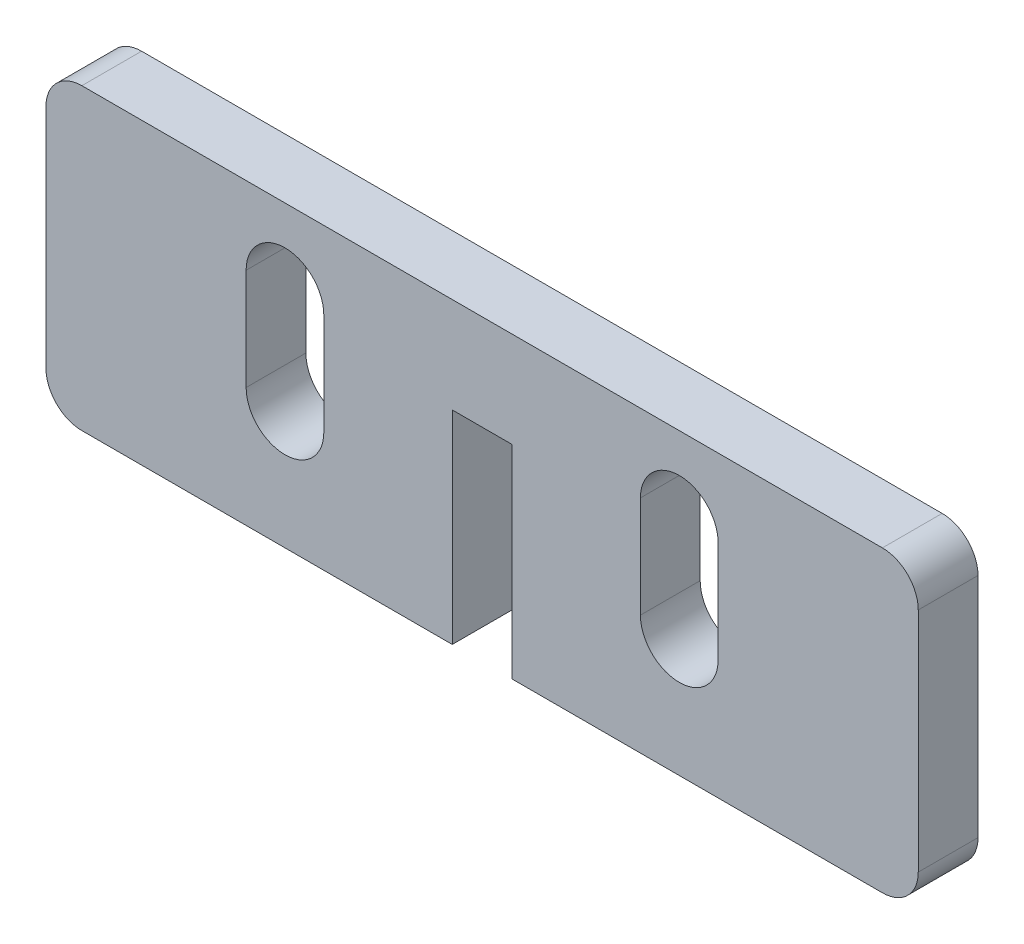
ISO-10303-21;
HEADER;
FILE_DESCRIPTION(('STEP AP214'),'2;1');
FILE_NAME('part.step','',(''),(''),'','','');
FILE_SCHEMA(('AUTOMOTIVE_DESIGN { 1 0 10303 214 1 1 1 1 }'));
ENDSEC;
DATA;
#1=APPLICATION_CONTEXT('core data for automotive mechanical design processes');
#2=APPLICATION_PROTOCOL_DEFINITION('international standard','automotive_design',2000,#1);
#3=PRODUCT_CONTEXT('',#1,'mechanical');
#4=PRODUCT('Part','Part','',(#3));
#5=PRODUCT_RELATED_PRODUCT_CATEGORY('part','',(#4));
#6=PRODUCT_DEFINITION_FORMATION('','',#4);
#7=PRODUCT_DEFINITION_CONTEXT('part definition',#1,'design');
#8=PRODUCT_DEFINITION('design','',#6,#7);
#9=PRODUCT_DEFINITION_SHAPE('','',#8);
#10=(LENGTH_UNIT() NAMED_UNIT(*) SI_UNIT(.MILLI.,.METRE.));
#11=(NAMED_UNIT(*) PLANE_ANGLE_UNIT() SI_UNIT($,.RADIAN.));
#12=(NAMED_UNIT(*) SI_UNIT($,.STERADIAN.) SOLID_ANGLE_UNIT());
#13=UNCERTAINTY_MEASURE_WITH_UNIT(LENGTH_MEASURE(1.E-05),#10,'distance_accuracy_value','');
#14=(GEOMETRIC_REPRESENTATION_CONTEXT(3) GLOBAL_UNCERTAINTY_ASSIGNED_CONTEXT((#13)) GLOBAL_UNIT_ASSIGNED_CONTEXT((#10,
#11,#12)) REPRESENTATION_CONTEXT('',''));
#15=CARTESIAN_POINT('',(0.,0.,0.));
#16=DIRECTION('',(0.,0.,1.));
#17=DIRECTION('',(1.,0.,0.));
#18=AXIS2_PLACEMENT_3D('',#15,#16,#17);
#19=CARTESIAN_POINT('',(33.5,-9.5,5.));
#20=DIRECTION('',(0.,0.,1.));
#21=DIRECTION('',(1.,0.,0.));
#22=AXIS2_PLACEMENT_3D('',#19,#20,#21);
#23=PLANE('',#22);
#24=DIRECTION('',(-1.,0.,0.));
#25=VECTOR('',#24,1.);
#26=CARTESIAN_POINT('',(33.5,4.5,5.));
#27=LINE('',#26,#25);
#28=CARTESIAN_POINT('',(2.50000000000001,4.5,5.));
#29=VERTEX_POINT('',#28);
#30=CARTESIAN_POINT('',(-2.49999999999999,4.5,5.));
#31=VERTEX_POINT('',#30);
#32=EDGE_CURVE('E192',#29,#31,#27,.T.);
#33=ORIENTED_EDGE('',*,*,#32,.F.);
#34=DIRECTION('',(0.,-1.,0.));
#35=VECTOR('',#34,1.);
#36=CARTESIAN_POINT('',(2.50000000000001,2.5,5.));
#37=LINE('',#36,#35);
#38=CARTESIAN_POINT('',(2.50000000000001,-12.5,5.));
#39=VERTEX_POINT('',#38);
#40=EDGE_CURVE('E265',#29,#39,#37,.T.);
#41=ORIENTED_EDGE('',*,*,#40,.T.);
#42=DIRECTION('',(1.,0.,0.));
#43=VECTOR('',#42,1.);
#44=CARTESIAN_POINT('',(2.50000000000001,-12.5,5.));
#45=LINE('',#44,#43);
#46=CARTESIAN_POINT('',(33.5,-12.5,5.));
#47=VERTEX_POINT('',#46);
#48=EDGE_CURVE('E267',#39,#47,#45,.T.);
#49=ORIENTED_EDGE('',*,*,#48,.T.);
#50=CARTESIAN_POINT('',(33.5,-9.5,5.));
#51=DIRECTION('',(0.,0.,1.));
#52=DIRECTION('',(1.,0.,0.));
#53=AXIS2_PLACEMENT_3D('',#50,#51,#52);
#54=CIRCLE('',#53,3.);
#55=CARTESIAN_POINT('',(36.5,-9.5,5.));
#56=VERTEX_POINT('',#55);
#57=EDGE_CURVE('E269',#47,#56,#54,.T.);
#58=ORIENTED_EDGE('',*,*,#57,.T.);
#59=DIRECTION('',(0.,1.,0.));
#60=VECTOR('',#59,1.);
#61=CARTESIAN_POINT('',(36.5,-9.49999999999998,5.));
#62=LINE('',#61,#60);
#63=CARTESIAN_POINT('',(36.5,9.49999999999998,5.));
#64=VERTEX_POINT('',#63);
#65=EDGE_CURVE('E271',#56,#64,#62,.T.);
#66=ORIENTED_EDGE('',*,*,#65,.T.);
#67=CARTESIAN_POINT('',(33.5,9.5,5.));
#68=DIRECTION('',(0.,0.,1.));
#69=DIRECTION('',(1.,0.,0.));
#70=AXIS2_PLACEMENT_3D('',#67,#68,#69);
#71=CIRCLE('',#70,3.);
#72=CARTESIAN_POINT('',(33.5,12.5,5.));
#73=VERTEX_POINT('',#72);
#74=EDGE_CURVE('E273',#64,#73,#71,.T.);
#75=ORIENTED_EDGE('',*,*,#74,.T.);
#76=DIRECTION('',(-1.,0.,0.));
#77=VECTOR('',#76,1.);
#78=CARTESIAN_POINT('',(33.5,12.5,5.));
#79=LINE('',#78,#77);
#80=CARTESIAN_POINT('',(-33.5,12.5,5.));
#81=VERTEX_POINT('',#80);
#82=EDGE_CURVE('E275',#73,#81,#79,.T.);
#83=ORIENTED_EDGE('',*,*,#82,.T.);
#84=CARTESIAN_POINT('',(-33.5,9.5,5.));
#85=DIRECTION('',(0.,0.,1.));
#86=DIRECTION('',(1.,0.,0.));
#87=AXIS2_PLACEMENT_3D('',#84,#85,#86);
#88=CIRCLE('',#87,3.);
#89=CARTESIAN_POINT('',(-36.5,9.49999999999998,5.));
#90=VERTEX_POINT('',#89);
#91=EDGE_CURVE('E277',#81,#90,#88,.T.);
#92=ORIENTED_EDGE('',*,*,#91,.T.);
#93=DIRECTION('',(0.,-1.,0.));
#94=VECTOR('',#93,1.);
#95=CARTESIAN_POINT('',(-36.5,-9.49999999999998,5.));
#96=LINE('',#95,#94);
#97=CARTESIAN_POINT('',(-36.5,-9.49999999999998,5.));
#98=VERTEX_POINT('',#97);
#99=EDGE_CURVE('E279',#90,#98,#96,.T.);
#100=ORIENTED_EDGE('',*,*,#99,.T.);
#101=CARTESIAN_POINT('',(-33.5,-9.5,5.));
#102=DIRECTION('',(0.,0.,1.));
#103=DIRECTION('',(-1.,0.,0.));
#104=AXIS2_PLACEMENT_3D('',#101,#102,#103);
#105=CIRCLE('',#104,3.);
#106=CARTESIAN_POINT('',(-33.5,-12.5,5.));
#107=VERTEX_POINT('',#106);
#108=EDGE_CURVE('E281',#98,#107,#105,.T.);
#109=ORIENTED_EDGE('',*,*,#108,.T.);
#110=DIRECTION('',(1.,0.,0.));
#111=VECTOR('',#110,1.);
#112=CARTESIAN_POINT('',(-33.5,-12.5,5.));
#113=LINE('',#112,#111);
#114=CARTESIAN_POINT('',(-2.49999999999999,-12.5,5.));
#115=VERTEX_POINT('',#114);
#116=EDGE_CURVE('E259',#107,#115,#113,.T.);
#117=ORIENTED_EDGE('',*,*,#116,.T.);
#118=DIRECTION('',(0.,1.,0.));
#119=VECTOR('',#118,1.);
#120=CARTESIAN_POINT('',(-2.49999999999999,2.5,5.));
#121=LINE('',#120,#119);
#122=EDGE_CURVE('E262',#115,#31,#121,.T.);
#123=ORIENTED_EDGE('',*,*,#122,.T.);
#124=EDGE_LOOP('',(#33,#41,#49,#58,#66,#75,#83,#92,#100,#109,#117,#123));
#125=FACE_BOUND('',#124,.T.);
#126=DIRECTION('',(0.,1.,0.));
#127=VECTOR('',#126,1.);
#128=CARTESIAN_POINT('',(-13.25,-2.50000000000001,5.));
#129=LINE('',#128,#127);
#130=CARTESIAN_POINT('',(-13.25,-2.50000000000001,5.));
#131=VERTEX_POINT('',#130);
#132=CARTESIAN_POINT('',(-13.25,5.99999999999999,5.));
#133=VERTEX_POINT('',#132);
#134=EDGE_CURVE('E231',#131,#133,#129,.T.);
#135=ORIENTED_EDGE('',*,*,#134,.F.);
#136=CARTESIAN_POINT('',(-16.5,-2.50000000000001,5.));
#137=DIRECTION('',(0.,0.,1.));
#138=DIRECTION('',(1.,0.,0.));
#139=AXIS2_PLACEMENT_3D('',#136,#137,#138);
#140=CIRCLE('',#139,3.25);
#141=CARTESIAN_POINT('',(-19.75,-2.50000000000001,5.));
#142=VERTEX_POINT('',#141);
#143=EDGE_CURVE('E229',#142,#131,#140,.T.);
#144=ORIENTED_EDGE('',*,*,#143,.F.);
#145=DIRECTION('',(0.,-1.,0.));
#146=VECTOR('',#145,1.);
#147=CARTESIAN_POINT('',(-19.75,-2.50000000000001,5.));
#148=LINE('',#147,#146);
#149=CARTESIAN_POINT('',(-19.75,5.99999999999999,5.));
#150=VERTEX_POINT('',#149);
#151=EDGE_CURVE('E237',#150,#142,#148,.T.);
#152=ORIENTED_EDGE('',*,*,#151,.F.);
#153=CARTESIAN_POINT('',(-16.5,5.99999999999999,5.));
#154=DIRECTION('',(0.,0.,1.));
#155=DIRECTION('',(1.,0.,0.));
#156=AXIS2_PLACEMENT_3D('',#153,#154,#155);
#157=CIRCLE('',#156,3.25);
#158=EDGE_CURVE('E234',#133,#150,#157,.T.);
#159=ORIENTED_EDGE('',*,*,#158,.F.);
#160=EDGE_LOOP('',(#135,#144,#152,#159));
#161=FACE_BOUND('',#160,.T.);
#162=DIRECTION('',(0.,1.,0.));
#163=VECTOR('',#162,1.);
#164=CARTESIAN_POINT('',(19.75,-2.5,5.));
#165=LINE('',#164,#163);
#166=CARTESIAN_POINT('',(19.75,-2.5,5.));
#167=VERTEX_POINT('',#166);
#168=CARTESIAN_POINT('',(19.75,6.,5.));
#169=VERTEX_POINT('',#168);
#170=EDGE_CURVE('E205',#167,#169,#165,.T.);
#171=ORIENTED_EDGE('',*,*,#170,.F.);
#172=CARTESIAN_POINT('',(16.5,-2.5,5.));
#173=DIRECTION('',(0.,0.,1.));
#174=DIRECTION('',(-1.,0.,0.));
#175=AXIS2_PLACEMENT_3D('',#172,#173,#174);
#176=CIRCLE('',#175,3.25);
#177=CARTESIAN_POINT('',(13.25,-2.5,5.));
#178=VERTEX_POINT('',#177);
#179=EDGE_CURVE('E203',#178,#167,#176,.T.);
#180=ORIENTED_EDGE('',*,*,#179,.F.);
#181=DIRECTION('',(0.,-1.,0.));
#182=VECTOR('',#181,1.);
#183=CARTESIAN_POINT('',(13.25,-2.5,5.));
#184=LINE('',#183,#182);
#185=CARTESIAN_POINT('',(13.25,6.,5.));
#186=VERTEX_POINT('',#185);
#187=EDGE_CURVE('E210',#186,#178,#184,.T.);
#188=ORIENTED_EDGE('',*,*,#187,.F.);
#189=CARTESIAN_POINT('',(16.5,6.,5.));
#190=DIRECTION('',(0.,0.,1.));
#191=DIRECTION('',(-1.,0.,0.));
#192=AXIS2_PLACEMENT_3D('',#189,#190,#191);
#193=CIRCLE('',#192,3.25);
#194=EDGE_CURVE('E208',#169,#186,#193,.T.);
#195=ORIENTED_EDGE('',*,*,#194,.F.);
#196=EDGE_LOOP('',(#171,#180,#188,#195));
#197=FACE_BOUND('',#196,.T.);
#198=ADVANCED_FACE('F35',(#125,#161,#197),#23,.T.);
#199=CARTESIAN_POINT('',(33.5,-9.5,0.));
#200=DIRECTION('',(0.,0.,1.));
#201=DIRECTION('',(1.,0.,0.));
#202=AXIS2_PLACEMENT_3D('',#199,#200,#201);
#203=PLANE('',#202);
#204=CARTESIAN_POINT('',(-16.5,-2.50000000000001,0.));
#205=DIRECTION('',(0.,0.,1.));
#206=DIRECTION('',(1.,0.,0.));
#207=AXIS2_PLACEMENT_3D('',#204,#205,#206);
#208=CIRCLE('',#207,3.25);
#209=CARTESIAN_POINT('',(-19.75,-2.50000000000001,0.));
#210=VERTEX_POINT('',#209);
#211=CARTESIAN_POINT('',(-13.25,-2.50000000000001,0.));
#212=VERTEX_POINT('',#211);
#213=EDGE_CURVE('E228',#210,#212,#208,.T.);
#214=ORIENTED_EDGE('',*,*,#213,.T.);
#215=DIRECTION('',(0.,1.,0.));
#216=VECTOR('',#215,1.);
#217=CARTESIAN_POINT('',(-13.25,-2.50000000000001,0.));
#218=LINE('',#217,#216);
#219=CARTESIAN_POINT('',(-13.25,5.99999999999999,0.));
#220=VERTEX_POINT('',#219);
#221=EDGE_CURVE('E242',#212,#220,#218,.T.);
#222=ORIENTED_EDGE('',*,*,#221,.T.);
#223=CARTESIAN_POINT('',(-16.5,5.99999999999999,0.));
#224=DIRECTION('',(0.,0.,1.));
#225=DIRECTION('',(1.,0.,0.));
#226=AXIS2_PLACEMENT_3D('',#223,#224,#225);
#227=CIRCLE('',#226,3.25);
#228=CARTESIAN_POINT('',(-19.75,5.99999999999999,0.));
#229=VERTEX_POINT('',#228);
#230=EDGE_CURVE('E245',#220,#229,#227,.T.);
#231=ORIENTED_EDGE('',*,*,#230,.T.);
#232=DIRECTION('',(0.,-1.,0.));
#233=VECTOR('',#232,1.);
#234=CARTESIAN_POINT('',(-19.75,-2.50000000000001,0.));
#235=LINE('',#234,#233);
#236=EDGE_CURVE('E232',#229,#210,#235,.T.);
#237=ORIENTED_EDGE('',*,*,#236,.T.);
#238=EDGE_LOOP('',(#214,#222,#231,#237));
#239=FACE_BOUND('',#238,.T.);
#240=DIRECTION('',(0.,-1.,0.));
#241=VECTOR('',#240,1.);
#242=CARTESIAN_POINT('',(2.50000000000001,2.5,0.));
#243=LINE('',#242,#241);
#244=CARTESIAN_POINT('',(2.50000000000001,4.5,0.));
#245=VERTEX_POINT('',#244);
#246=CARTESIAN_POINT('',(2.50000000000001,-12.5,0.));
#247=VERTEX_POINT('',#246);
#248=EDGE_CURVE('E182',#245,#247,#243,.T.);
#249=ORIENTED_EDGE('',*,*,#248,.F.);
#250=DIRECTION('',(1.,0.,0.));
#251=VECTOR('',#250,1.);
#252=CARTESIAN_POINT('',(2.50000000000001,4.5,0.));
#253=LINE('',#252,#251);
#254=CARTESIAN_POINT('',(-2.49999999999999,4.5,0.));
#255=VERTEX_POINT('',#254);
#256=EDGE_CURVE('E190',#255,#245,#253,.T.);
#257=ORIENTED_EDGE('',*,*,#256,.F.);
#258=DIRECTION('',(0.,1.,0.));
#259=VECTOR('',#258,1.);
#260=CARTESIAN_POINT('',(-2.49999999999999,2.5,0.));
#261=LINE('',#260,#259);
#262=CARTESIAN_POINT('',(-2.49999999999999,-12.5,0.));
#263=VERTEX_POINT('',#262);
#264=EDGE_CURVE('E173',#263,#255,#261,.T.);
#265=ORIENTED_EDGE('',*,*,#264,.F.);
#266=DIRECTION('',(1.,0.,0.));
#267=VECTOR('',#266,1.);
#268=CARTESIAN_POINT('',(-33.5,-12.5,0.));
#269=LINE('',#268,#267);
#270=CARTESIAN_POINT('',(-33.5,-12.5,0.));
#271=VERTEX_POINT('',#270);
#272=EDGE_CURVE('E183',#271,#263,#269,.T.);
#273=ORIENTED_EDGE('',*,*,#272,.F.);
#274=CARTESIAN_POINT('',(-33.5,-9.5,0.));
#275=DIRECTION('',(0.,0.,1.));
#276=DIRECTION('',(-1.,0.,0.));
#277=AXIS2_PLACEMENT_3D('',#274,#275,#276);
#278=CIRCLE('',#277,3.);
#279=CARTESIAN_POINT('',(-36.5,-9.49999999999998,0.));
#280=VERTEX_POINT('',#279);
#281=EDGE_CURVE('E263',#280,#271,#278,.T.);
#282=ORIENTED_EDGE('',*,*,#281,.F.);
#283=DIRECTION('',(0.,-1.,0.));
#284=VECTOR('',#283,1.);
#285=CARTESIAN_POINT('',(-36.5,-9.49999999999998,0.));
#286=LINE('',#285,#284);
#287=CARTESIAN_POINT('',(-36.5,9.49999999999998,0.));
#288=VERTEX_POINT('',#287);
#289=EDGE_CURVE('E298',#288,#280,#286,.T.);
#290=ORIENTED_EDGE('',*,*,#289,.F.);
#291=CARTESIAN_POINT('',(-33.5,9.5,0.));
#292=DIRECTION('',(0.,0.,1.));
#293=DIRECTION('',(1.,0.,0.));
#294=AXIS2_PLACEMENT_3D('',#291,#292,#293);
#295=CIRCLE('',#294,3.);
#296=CARTESIAN_POINT('',(-33.5,12.5,0.));
#297=VERTEX_POINT('',#296);
#298=EDGE_CURVE('E296',#297,#288,#295,.T.);
#299=ORIENTED_EDGE('',*,*,#298,.F.);
#300=DIRECTION('',(-1.,0.,0.));
#301=VECTOR('',#300,1.);
#302=CARTESIAN_POINT('',(33.5,12.5,0.));
#303=LINE('',#302,#301);
#304=CARTESIAN_POINT('',(33.5,12.5,0.));
#305=VERTEX_POINT('',#304);
#306=EDGE_CURVE('E294',#305,#297,#303,.T.);
#307=ORIENTED_EDGE('',*,*,#306,.F.);
#308=CARTESIAN_POINT('',(33.5,9.5,0.));
#309=DIRECTION('',(0.,0.,1.));
#310=DIRECTION('',(1.,0.,0.));
#311=AXIS2_PLACEMENT_3D('',#308,#309,#310);
#312=CIRCLE('',#311,3.);
#313=CARTESIAN_POINT('',(36.5,9.49999999999998,0.));
#314=VERTEX_POINT('',#313);
#315=EDGE_CURVE('E292',#314,#305,#312,.T.);
#316=ORIENTED_EDGE('',*,*,#315,.F.);
#317=DIRECTION('',(0.,1.,0.));
#318=VECTOR('',#317,1.);
#319=CARTESIAN_POINT('',(36.5,-9.49999999999998,0.));
#320=LINE('',#319,#318);
#321=CARTESIAN_POINT('',(36.5,-9.5,0.));
#322=VERTEX_POINT('',#321);
#323=EDGE_CURVE('E290',#322,#314,#320,.T.);
#324=ORIENTED_EDGE('',*,*,#323,.F.);
#325=CARTESIAN_POINT('',(33.5,-9.5,0.));
#326=DIRECTION('',(0.,0.,1.));
#327=DIRECTION('',(1.,0.,0.));
#328=AXIS2_PLACEMENT_3D('',#325,#326,#327);
#329=CIRCLE('',#328,3.);
#330=CARTESIAN_POINT('',(33.5,-12.5,0.));
#331=VERTEX_POINT('',#330);
#332=EDGE_CURVE('E288',#331,#322,#329,.T.);
#333=ORIENTED_EDGE('',*,*,#332,.F.);
#334=DIRECTION('',(1.,0.,0.));
#335=VECTOR('',#334,1.);
#336=CARTESIAN_POINT('',(2.50000000000001,-12.5,0.));
#337=LINE('',#336,#335);
#338=EDGE_CURVE('E286',#247,#331,#337,.T.);
#339=ORIENTED_EDGE('',*,*,#338,.F.);
#340=EDGE_LOOP('',(#249,#257,#265,#273,#282,#290,#299,#307,#316,#324,#333,#339));
#341=FACE_BOUND('',#340,.T.);
#342=CARTESIAN_POINT('',(16.5,-2.5,0.));
#343=DIRECTION('',(0.,0.,1.));
#344=DIRECTION('',(-1.,0.,0.));
#345=AXIS2_PLACEMENT_3D('',#342,#343,#344);
#346=CIRCLE('',#345,3.25);
#347=CARTESIAN_POINT('',(13.25,-2.5,0.));
#348=VERTEX_POINT('',#347);
#349=CARTESIAN_POINT('',(19.75,-2.5,0.));
#350=VERTEX_POINT('',#349);
#351=EDGE_CURVE('E58',#348,#350,#346,.T.);
#352=ORIENTED_EDGE('',*,*,#351,.T.);
#353=DIRECTION('',(0.,1.,0.));
#354=VECTOR('',#353,1.);
#355=CARTESIAN_POINT('',(19.75,-2.5,0.));
#356=LINE('',#355,#354);
#357=CARTESIAN_POINT('',(19.75,6.,0.));
#358=VERTEX_POINT('',#357);
#359=EDGE_CURVE('E214',#350,#358,#356,.T.);
#360=ORIENTED_EDGE('',*,*,#359,.T.);
#361=CARTESIAN_POINT('',(16.5,6.,0.));
#362=DIRECTION('',(0.,0.,1.));
#363=DIRECTION('',(-1.,0.,0.));
#364=AXIS2_PLACEMENT_3D('',#361,#362,#363);
#365=CIRCLE('',#364,3.25);
#366=CARTESIAN_POINT('',(13.25,6.,0.));
#367=VERTEX_POINT('',#366);
#368=EDGE_CURVE('E217',#358,#367,#365,.T.);
#369=ORIENTED_EDGE('',*,*,#368,.T.);
#370=DIRECTION('',(0.,-1.,0.));
#371=VECTOR('',#370,1.);
#372=CARTESIAN_POINT('',(13.25,-2.5,0.));
#373=LINE('',#372,#371);
#374=EDGE_CURVE('E206',#367,#348,#373,.T.);
#375=ORIENTED_EDGE('',*,*,#374,.T.);
#376=EDGE_LOOP('',(#352,#360,#369,#375));
#377=FACE_BOUND('',#376,.T.);
#378=ADVANCED_FACE('F195',(#239,#341,#377),#203,.F.);
#379=CARTESIAN_POINT('',(-33.5,-12.5,5.));
#380=DIRECTION('',(0.,1.,0.));
#381=DIRECTION('',(0.,0.,1.));
#382=AXIS2_PLACEMENT_3D('',#379,#380,#381);
#383=PLANE('',#382);
#384=ORIENTED_EDGE('',*,*,#272,.T.);
#385=DIRECTION('',(0.,0.,-1.));
#386=VECTOR('',#385,1.);
#387=CARTESIAN_POINT('',(-2.49999999999999,-12.5,5.));
#388=LINE('',#387,#386);
#389=EDGE_CURVE('E11',#115,#263,#388,.T.);
#390=ORIENTED_EDGE('',*,*,#389,.F.);
#391=ORIENTED_EDGE('',*,*,#116,.F.);
#392=DIRECTION('',(0.,0.,-1.));
#393=VECTOR('',#392,1.);
#394=CARTESIAN_POINT('',(-33.5,-12.5,5.));
#395=LINE('',#394,#393);
#396=EDGE_CURVE('E283',#107,#271,#395,.T.);
#397=ORIENTED_EDGE('',*,*,#396,.T.);
#398=EDGE_LOOP('',(#384,#390,#391,#397));
#399=FACE_BOUND('',#398,.T.);
#400=ADVANCED_FACE('F37',(#399),#383,.F.);
#401=CARTESIAN_POINT('',(-2.49999999999999,2.5,5.));
#402=DIRECTION('',(-1.,0.,0.));
#403=DIRECTION('',(0.,-1.,0.));
#404=AXIS2_PLACEMENT_3D('',#401,#402,#403);
#405=PLANE('',#404);
#406=ORIENTED_EDGE('',*,*,#264,.T.);
#407=DIRECTION('',(0.,0.,-1.));
#408=VECTOR('',#407,1.);
#409=CARTESIAN_POINT('',(-2.49999999999999,4.5,10.));
#410=LINE('',#409,#408);
#411=EDGE_CURVE('E176',#31,#255,#410,.T.);
#412=ORIENTED_EDGE('',*,*,#411,.F.);
#413=ORIENTED_EDGE('',*,*,#122,.F.);
#414=ORIENTED_EDGE('',*,*,#389,.T.);
#415=EDGE_LOOP('',(#406,#412,#413,#414));
#416=FACE_BOUND('',#415,.T.);
#417=ADVANCED_FACE('F175',(#416),#405,.F.);
#418=CARTESIAN_POINT('',(2.50000000000001,2.5,5.));
#419=DIRECTION('',(1.,0.,0.));
#420=DIRECTION('',(0.,1.,0.));
#421=AXIS2_PLACEMENT_3D('',#418,#419,#420);
#422=PLANE('',#421);
#423=ORIENTED_EDGE('',*,*,#248,.T.);
#424=DIRECTION('',(0.,0.,-1.));
#425=VECTOR('',#424,1.);
#426=CARTESIAN_POINT('',(2.50000000000001,-12.5,5.));
#427=LINE('',#426,#425);
#428=EDGE_CURVE('E43',#39,#247,#427,.T.);
#429=ORIENTED_EDGE('',*,*,#428,.F.);
#430=ORIENTED_EDGE('',*,*,#40,.F.);
#431=DIRECTION('',(0.,0.,-1.));
#432=VECTOR('',#431,1.);
#433=CARTESIAN_POINT('',(2.50000000000001,4.5,10.));
#434=LINE('',#433,#432);
#435=EDGE_CURVE('E193',#29,#245,#434,.T.);
#436=ORIENTED_EDGE('',*,*,#435,.T.);
#437=EDGE_LOOP('',(#423,#429,#430,#436));
#438=FACE_BOUND('',#437,.T.);
#439=ADVANCED_FACE('F345',(#438),#422,.F.);
#440=CARTESIAN_POINT('',(2.50000000000001,-12.5,5.));
#441=DIRECTION('',(0.,1.,0.));
#442=DIRECTION('',(-1.,0.,0.));
#443=AXIS2_PLACEMENT_3D('',#440,#441,#442);
#444=PLANE('',#443);
#445=ORIENTED_EDGE('',*,*,#338,.T.);
#446=DIRECTION('',(0.,0.,-1.));
#447=VECTOR('',#446,1.);
#448=CARTESIAN_POINT('',(33.5,-12.5,5.));
#449=LINE('',#448,#447);
#450=EDGE_CURVE('E321',#47,#331,#449,.T.);
#451=ORIENTED_EDGE('',*,*,#450,.F.);
#452=ORIENTED_EDGE('',*,*,#48,.F.);
#453=ORIENTED_EDGE('',*,*,#428,.T.);
#454=EDGE_LOOP('',(#445,#451,#452,#453));
#455=FACE_BOUND('',#454,.T.);
#456=ADVANCED_FACE('F327',(#455),#444,.F.);
#457=CARTESIAN_POINT('',(33.5,-9.5,5.));
#458=DIRECTION('',(0.,0.,-1.));
#459=DIRECTION('',(-1.,0.,0.));
#460=AXIS2_PLACEMENT_3D('',#457,#458,#459);
#461=CYLINDRICAL_SURFACE('',#460,3.);
#462=ORIENTED_EDGE('',*,*,#332,.T.);
#463=DIRECTION('',(0.,0.,-1.));
#464=VECTOR('',#463,1.);
#465=CARTESIAN_POINT('',(36.5,-9.5,5.));
#466=LINE('',#465,#464);
#467=EDGE_CURVE('E318',#56,#322,#466,.T.);
#468=ORIENTED_EDGE('',*,*,#467,.F.);
#469=ORIENTED_EDGE('',*,*,#57,.F.);
#470=ORIENTED_EDGE('',*,*,#450,.T.);
#471=EDGE_LOOP('',(#462,#468,#469,#470));
#472=FACE_BOUND('',#471,.T.);
#473=ADVANCED_FACE('F335',(#472),#461,.T.);
#474=CARTESIAN_POINT('',(36.5,-9.49999999999998,5.));
#475=DIRECTION('',(-1.,0.,0.));
#476=DIRECTION('',(0.,0.,1.));
#477=AXIS2_PLACEMENT_3D('',#474,#475,#476);
#478=PLANE('',#477);
#479=ORIENTED_EDGE('',*,*,#323,.T.);
#480=DIRECTION('',(0.,0.,-1.));
#481=VECTOR('',#480,1.);
#482=CARTESIAN_POINT('',(36.5,9.49999999999998,5.));
#483=LINE('',#482,#481);
#484=EDGE_CURVE('E315',#64,#314,#483,.T.);
#485=ORIENTED_EDGE('',*,*,#484,.F.);
#486=ORIENTED_EDGE('',*,*,#65,.F.);
#487=ORIENTED_EDGE('',*,*,#467,.T.);
#488=EDGE_LOOP('',(#479,#485,#486,#487));
#489=FACE_BOUND('',#488,.T.);
#490=ADVANCED_FACE('F339',(#489),#478,.F.);
#491=CARTESIAN_POINT('',(33.5,9.5,5.));
#492=DIRECTION('',(0.,0.,-1.));
#493=DIRECTION('',(-1.,0.,0.));
#494=AXIS2_PLACEMENT_3D('',#491,#492,#493);
#495=CYLINDRICAL_SURFACE('',#494,3.);
#496=ORIENTED_EDGE('',*,*,#315,.T.);
#497=DIRECTION('',(0.,0.,-1.));
#498=VECTOR('',#497,1.);
#499=CARTESIAN_POINT('',(33.5,12.5,5.));
#500=LINE('',#499,#498);
#501=EDGE_CURVE('E312',#73,#305,#500,.T.);
#502=ORIENTED_EDGE('',*,*,#501,.F.);
#503=ORIENTED_EDGE('',*,*,#74,.F.);
#504=ORIENTED_EDGE('',*,*,#484,.T.);
#505=EDGE_LOOP('',(#496,#502,#503,#504));
#506=FACE_BOUND('',#505,.T.);
#507=ADVANCED_FACE('F379',(#506),#495,.T.);
#508=CARTESIAN_POINT('',(33.5,12.5,5.));
#509=DIRECTION('',(0.,-1.,0.));
#510=DIRECTION('',(0.,0.,-1.));
#511=AXIS2_PLACEMENT_3D('',#508,#509,#510);
#512=PLANE('',#511);
#513=ORIENTED_EDGE('',*,*,#306,.T.);
#514=DIRECTION('',(0.,0.,-1.));
#515=VECTOR('',#514,1.);
#516=CARTESIAN_POINT('',(-33.5,12.5,5.));
#517=LINE('',#516,#515);
#518=EDGE_CURVE('E309',#81,#297,#517,.T.);
#519=ORIENTED_EDGE('',*,*,#518,.F.);
#520=ORIENTED_EDGE('',*,*,#82,.F.);
#521=ORIENTED_EDGE('',*,*,#501,.T.);
#522=EDGE_LOOP('',(#513,#519,#520,#521));
#523=FACE_BOUND('',#522,.T.);
#524=ADVANCED_FACE('F375',(#523),#512,.F.);
#525=CARTESIAN_POINT('',(-33.5,9.5,5.));
#526=DIRECTION('',(0.,0.,-1.));
#527=DIRECTION('',(-1.,0.,0.));
#528=AXIS2_PLACEMENT_3D('',#525,#526,#527);
#529=CYLINDRICAL_SURFACE('',#528,3.);
#530=ORIENTED_EDGE('',*,*,#298,.T.);
#531=DIRECTION('',(0.,0.,-1.));
#532=VECTOR('',#531,1.);
#533=CARTESIAN_POINT('',(-36.5,9.49999999999998,5.));
#534=LINE('',#533,#532);
#535=EDGE_CURVE('E306',#90,#288,#534,.T.);
#536=ORIENTED_EDGE('',*,*,#535,.F.);
#537=ORIENTED_EDGE('',*,*,#91,.F.);
#538=ORIENTED_EDGE('',*,*,#518,.T.);
#539=EDGE_LOOP('',(#530,#536,#537,#538));
#540=FACE_BOUND('',#539,.T.);
#541=ADVANCED_FACE('F371',(#540),#529,.T.);
#542=CARTESIAN_POINT('',(-36.5,-9.49999999999998,5.));
#543=DIRECTION('',(1.,0.,0.));
#544=DIRECTION('',(0.,0.,-1.));
#545=AXIS2_PLACEMENT_3D('',#542,#543,#544);
#546=PLANE('',#545);
#547=ORIENTED_EDGE('',*,*,#289,.T.);
#548=DIRECTION('',(0.,0.,-1.));
#549=VECTOR('',#548,1.);
#550=CARTESIAN_POINT('',(-36.5,-9.49999999999998,5.));
#551=LINE('',#550,#549);
#552=EDGE_CURVE('E303',#98,#280,#551,.T.);
#553=ORIENTED_EDGE('',*,*,#552,.F.);
#554=ORIENTED_EDGE('',*,*,#99,.F.);
#555=ORIENTED_EDGE('',*,*,#535,.T.);
#556=EDGE_LOOP('',(#547,#553,#554,#555));
#557=FACE_BOUND('',#556,.T.);
#558=ADVANCED_FACE('F367',(#557),#546,.F.);
#559=CARTESIAN_POINT('',(-33.5,-9.5,5.));
#560=DIRECTION('',(0.,0.,-1.));
#561=DIRECTION('',(-1.,0.,0.));
#562=AXIS2_PLACEMENT_3D('',#559,#560,#561);
#563=CYLINDRICAL_SURFACE('',#562,3.);
#564=ORIENTED_EDGE('',*,*,#281,.T.);
#565=ORIENTED_EDGE('',*,*,#396,.F.);
#566=ORIENTED_EDGE('',*,*,#108,.F.);
#567=ORIENTED_EDGE('',*,*,#552,.T.);
#568=EDGE_LOOP('',(#564,#565,#566,#567));
#569=FACE_BOUND('',#568,.T.);
#570=ADVANCED_FACE('F364',(#569),#563,.T.);
#571=CARTESIAN_POINT('',(-16.5,-2.50000000000001,5.));
#572=DIRECTION('',(0.,0.,-1.));
#573=DIRECTION('',(-1.,0.,0.));
#574=AXIS2_PLACEMENT_3D('',#571,#572,#573);
#575=CYLINDRICAL_SURFACE('',#574,3.25);
#576=ORIENTED_EDGE('',*,*,#213,.F.);
#577=DIRECTION('',(0.,0.,-1.));
#578=VECTOR('',#577,1.);
#579=CARTESIAN_POINT('',(-19.75,-2.50000000000001,5.));
#580=LINE('',#579,#578);
#581=EDGE_CURVE('E239',#142,#210,#580,.T.);
#582=ORIENTED_EDGE('',*,*,#581,.F.);
#583=ORIENTED_EDGE('',*,*,#143,.T.);
#584=DIRECTION('',(0.,0.,-1.));
#585=VECTOR('',#584,1.);
#586=CARTESIAN_POINT('',(-13.25,-2.50000000000001,5.));
#587=LINE('',#586,#585);
#588=EDGE_CURVE('E256',#131,#212,#587,.T.);
#589=ORIENTED_EDGE('',*,*,#588,.T.);
#590=EDGE_LOOP('',(#576,#582,#583,#589));
#591=FACE_BOUND('',#590,.T.);
#592=ADVANCED_FACE('F361',(#591),#575,.F.);
#593=CARTESIAN_POINT('',(-13.25,-2.50000000000001,5.));
#594=DIRECTION('',(-1.,0.,0.));
#595=DIRECTION('',(0.,-1.,0.));
#596=AXIS2_PLACEMENT_3D('',#593,#594,#595);
#597=PLANE('',#596);
#598=ORIENTED_EDGE('',*,*,#221,.F.);
#599=ORIENTED_EDGE('',*,*,#588,.F.);
#600=ORIENTED_EDGE('',*,*,#134,.T.);
#601=DIRECTION('',(0.,0.,-1.));
#602=VECTOR('',#601,1.);
#603=CARTESIAN_POINT('',(-13.25,5.99999999999999,5.));
#604=LINE('',#603,#602);
#605=EDGE_CURVE('E254',#133,#220,#604,.T.);
#606=ORIENTED_EDGE('',*,*,#605,.T.);
#607=EDGE_LOOP('',(#598,#599,#600,#606));
#608=FACE_BOUND('',#607,.T.);
#609=ADVANCED_FACE('F421',(#608),#597,.T.);
#610=CARTESIAN_POINT('',(-16.5,5.99999999999999,5.));
#611=DIRECTION('',(0.,0.,-1.));
#612=DIRECTION('',(-1.,0.,0.));
#613=AXIS2_PLACEMENT_3D('',#610,#611,#612);
#614=CYLINDRICAL_SURFACE('',#613,3.25);
#615=ORIENTED_EDGE('',*,*,#230,.F.);
#616=ORIENTED_EDGE('',*,*,#605,.F.);
#617=ORIENTED_EDGE('',*,*,#158,.T.);
#618=DIRECTION('',(0.,0.,-1.));
#619=VECTOR('',#618,1.);
#620=CARTESIAN_POINT('',(-19.75,5.99999999999999,5.));
#621=LINE('',#620,#619);
#622=EDGE_CURVE('E252',#150,#229,#621,.T.);
#623=ORIENTED_EDGE('',*,*,#622,.T.);
#624=EDGE_LOOP('',(#615,#616,#617,#623));
#625=FACE_BOUND('',#624,.T.);
#626=ADVANCED_FACE('F428',(#625),#614,.F.);
#627=CARTESIAN_POINT('',(-19.75,-2.50000000000001,5.));
#628=DIRECTION('',(1.,0.,0.));
#629=DIRECTION('',(0.,1.,0.));
#630=AXIS2_PLACEMENT_3D('',#627,#628,#629);
#631=PLANE('',#630);
#632=ORIENTED_EDGE('',*,*,#236,.F.);
#633=ORIENTED_EDGE('',*,*,#622,.F.);
#634=ORIENTED_EDGE('',*,*,#151,.T.);
#635=ORIENTED_EDGE('',*,*,#581,.T.);
#636=EDGE_LOOP('',(#632,#633,#634,#635));
#637=FACE_BOUND('',#636,.T.);
#638=ADVANCED_FACE('F435',(#637),#631,.T.);
#639=CARTESIAN_POINT('',(16.5,-2.5,5.));
#640=DIRECTION('',(0.,0.,-1.));
#641=DIRECTION('',(-1.,0.,0.));
#642=AXIS2_PLACEMENT_3D('',#639,#640,#641);
#643=CYLINDRICAL_SURFACE('',#642,3.25);
#644=ORIENTED_EDGE('',*,*,#351,.F.);
#645=DIRECTION('',(0.,0.,-1.));
#646=VECTOR('',#645,1.);
#647=CARTESIAN_POINT('',(13.25,-2.5,5.));
#648=LINE('',#647,#646);
#649=EDGE_CURVE('E212',#178,#348,#648,.T.);
#650=ORIENTED_EDGE('',*,*,#649,.F.);
#651=ORIENTED_EDGE('',*,*,#179,.T.);
#652=DIRECTION('',(0.,0.,-1.));
#653=VECTOR('',#652,1.);
#654=CARTESIAN_POINT('',(19.75,-2.5,5.));
#655=LINE('',#654,#653);
#656=EDGE_CURVE('E226',#167,#350,#655,.T.);
#657=ORIENTED_EDGE('',*,*,#656,.T.);
#658=EDGE_LOOP('',(#644,#650,#651,#657));
#659=FACE_BOUND('',#658,.T.);
#660=ADVANCED_FACE('F443',(#659),#643,.F.);
#661=CARTESIAN_POINT('',(19.75,-2.5,5.));
#662=DIRECTION('',(-1.,0.,0.));
#663=DIRECTION('',(0.,-1.,0.));
#664=AXIS2_PLACEMENT_3D('',#661,#662,#663);
#665=PLANE('',#664);
#666=ORIENTED_EDGE('',*,*,#359,.F.);
#667=ORIENTED_EDGE('',*,*,#656,.F.);
#668=ORIENTED_EDGE('',*,*,#170,.T.);
#669=DIRECTION('',(0.,0.,-1.));
#670=VECTOR('',#669,1.);
#671=CARTESIAN_POINT('',(19.75,6.,5.));
#672=LINE('',#671,#670);
#673=EDGE_CURVE('E224',#169,#358,#672,.T.);
#674=ORIENTED_EDGE('',*,*,#673,.T.);
#675=EDGE_LOOP('',(#666,#667,#668,#674));
#676=FACE_BOUND('',#675,.T.);
#677=ADVANCED_FACE('F451',(#676),#665,.T.);
#678=CARTESIAN_POINT('',(16.5,6.,5.));
#679=DIRECTION('',(0.,0.,-1.));
#680=DIRECTION('',(-1.,0.,0.));
#681=AXIS2_PLACEMENT_3D('',#678,#679,#680);
#682=CYLINDRICAL_SURFACE('',#681,3.25);
#683=ORIENTED_EDGE('',*,*,#368,.F.);
#684=ORIENTED_EDGE('',*,*,#673,.F.);
#685=ORIENTED_EDGE('',*,*,#194,.T.);
#686=DIRECTION('',(0.,0.,-1.));
#687=VECTOR('',#686,1.);
#688=CARTESIAN_POINT('',(13.25,6.,5.));
#689=LINE('',#688,#687);
#690=EDGE_CURVE('E50',#186,#367,#689,.T.);
#691=ORIENTED_EDGE('',*,*,#690,.T.);
#692=EDGE_LOOP('',(#683,#684,#685,#691));
#693=FACE_BOUND('',#692,.T.);
#694=ADVANCED_FACE('F458',(#693),#682,.F.);
#695=CARTESIAN_POINT('',(13.25,-2.5,5.));
#696=DIRECTION('',(1.,0.,0.));
#697=DIRECTION('',(0.,0.,-1.));
#698=AXIS2_PLACEMENT_3D('',#695,#696,#697);
#699=PLANE('',#698);
#700=ORIENTED_EDGE('',*,*,#374,.F.);
#701=ORIENTED_EDGE('',*,*,#690,.F.);
#702=ORIENTED_EDGE('',*,*,#187,.T.);
#703=ORIENTED_EDGE('',*,*,#649,.T.);
#704=EDGE_LOOP('',(#700,#701,#702,#703));
#705=FACE_BOUND('',#704,.T.);
#706=ADVANCED_FACE('F466',(#705),#699,.T.);
#707=CARTESIAN_POINT('',(2.50000000000001,4.5,10.));
#708=DIRECTION('',(0.,1.,0.));
#709=DIRECTION('',(0.,0.,1.));
#710=AXIS2_PLACEMENT_3D('',#707,#708,#709);
#711=PLANE('',#710);
#712=ORIENTED_EDGE('',*,*,#32,.T.);
#713=ORIENTED_EDGE('',*,*,#411,.T.);
#714=ORIENTED_EDGE('',*,*,#256,.T.);
#715=ORIENTED_EDGE('',*,*,#435,.F.);
#716=EDGE_LOOP('',(#712,#713,#714,#715));
#717=FACE_BOUND('',#716,.T.);
#718=ADVANCED_FACE('F188',(#717),#711,.F.);
#719=CLOSED_SHELL('',(#198,#378,#400,#417,#439,#456,#473,#490,#507,#524,#541,#558,#570,#592,
#609,#626,#638,#660,#677,#694,#706,#718));
#720=MANIFOLD_SOLID_BREP('B2',#719);
#721=ADVANCED_BREP_SHAPE_REPRESENTATION('',(#18,#720),#14);
#722=SHAPE_DEFINITION_REPRESENTATION(#9,#721);
ENDSEC;
END-ISO-10303-21;
